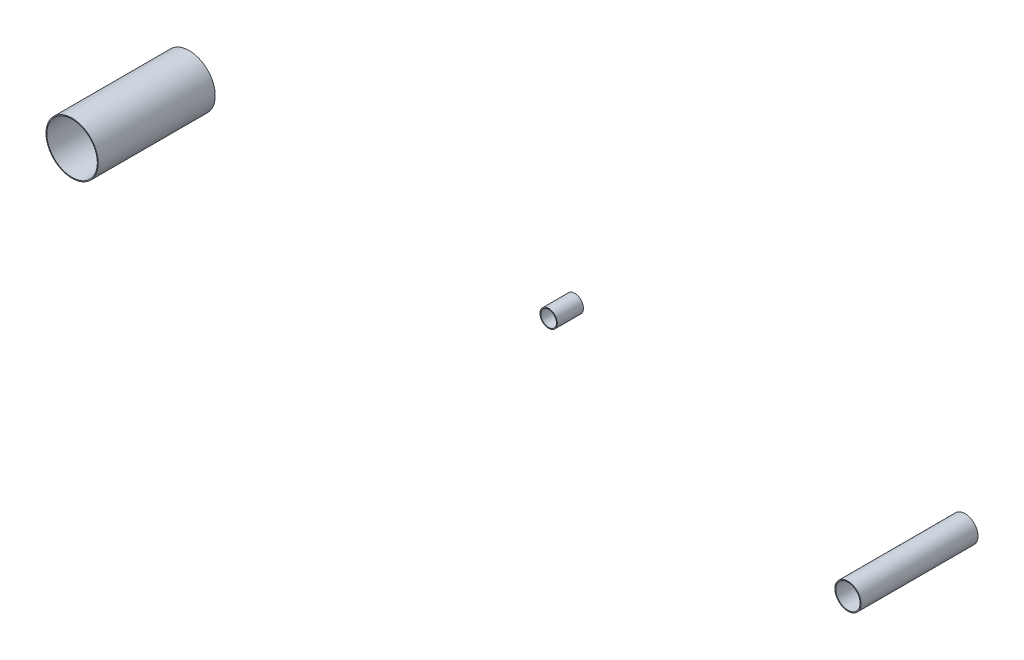
ISO-10303-21;
HEADER;
FILE_DESCRIPTION(('STEP AP214'),'2;1');
FILE_NAME('part.step','',(''),(''),'','','');
FILE_SCHEMA(('AUTOMOTIVE_DESIGN { 1 0 10303 214 1 1 1 1 }'));
ENDSEC;
DATA;
#1=APPLICATION_CONTEXT('core data for automotive mechanical design processes');
#2=APPLICATION_PROTOCOL_DEFINITION('international standard','automotive_design',2000,#1);
#3=PRODUCT_CONTEXT('',#1,'mechanical');
#4=PRODUCT('Part','Part','',(#3));
#5=PRODUCT_RELATED_PRODUCT_CATEGORY('part','',(#4));
#6=PRODUCT_DEFINITION_FORMATION('','',#4);
#7=PRODUCT_DEFINITION_CONTEXT('part definition',#1,'design');
#8=PRODUCT_DEFINITION('design','',#6,#7);
#9=PRODUCT_DEFINITION_SHAPE('','',#8);
#10=(LENGTH_UNIT() NAMED_UNIT(*) SI_UNIT(.MILLI.,.METRE.));
#11=(NAMED_UNIT(*) PLANE_ANGLE_UNIT() SI_UNIT($,.RADIAN.));
#12=(NAMED_UNIT(*) SI_UNIT($,.STERADIAN.) SOLID_ANGLE_UNIT());
#13=UNCERTAINTY_MEASURE_WITH_UNIT(LENGTH_MEASURE(1.E-05),#10,'distance_accuracy_value','');
#14=(GEOMETRIC_REPRESENTATION_CONTEXT(3) GLOBAL_UNCERTAINTY_ASSIGNED_CONTEXT((#13)) GLOBAL_UNIT_ASSIGNED_CONTEXT((#10,
#11,#12)) REPRESENTATION_CONTEXT('',''));
#15=CARTESIAN_POINT('',(0.,0.,0.));
#16=DIRECTION('',(0.,0.,1.));
#17=DIRECTION('',(1.,0.,0.));
#18=AXIS2_PLACEMENT_3D('',#15,#16,#17);
#19=CARTESIAN_POINT('',(-31046.0335157072,-16257.8595062918,41013.2906960563));
#20=DIRECTION('',(0.,0.,-1.));
#21=DIRECTION('',(-1.,0.,0.));
#22=AXIS2_PLACEMENT_3D('',#19,#20,#21);
#23=PLANE('',#22);
#24=CARTESIAN_POINT('',(-31046.0335157072,-16257.8595062918,41013.2906960563));
#25=DIRECTION('',(0.,0.,-1.));
#26=DIRECTION('',(-1.,0.,0.));
#27=AXIS2_PLACEMENT_3D('',#24,#25,#26);
#28=CIRCLE('',#27,14.0000000000006);
#29=CARTESIAN_POINT('',(-31060.0335157072,-16257.8595062918,41013.2906960563));
#30=VERTEX_POINT('',#29);
#31=EDGE_CURVE('E76',#30,#30,#28,.T.);
#32=ORIENTED_EDGE('',*,*,#31,.T.);
#33=EDGE_LOOP('',(#32));
#34=FACE_BOUND('',#33,.T.);
#35=CARTESIAN_POINT('',(-31046.0335157072,-16257.8595062918,41013.2906960563));
#36=DIRECTION('',(0.,0.,-1.));
#37=DIRECTION('',(-1.,0.,0.));
#38=AXIS2_PLACEMENT_3D('',#35,#36,#37);
#39=CIRCLE('',#38,15.0000000000006);
#40=CARTESIAN_POINT('',(-31061.0335157072,-16257.8595062918,41013.2906960563));
#41=VERTEX_POINT('',#40);
#42=EDGE_CURVE('E68',#41,#41,#39,.T.);
#43=ORIENTED_EDGE('',*,*,#42,.F.);
#44=EDGE_LOOP('',(#43));
#45=FACE_BOUND('',#44,.T.);
#46=ADVANCED_FACE('F62',(#34,#45),#23,.F.);
#47=CARTESIAN_POINT('',(-31046.0335157072,-16257.8595062918,40878.7861311589));
#48=DIRECTION('',(0.,0.,-1.));
#49=DIRECTION('',(-1.,0.,0.));
#50=AXIS2_PLACEMENT_3D('',#47,#48,#49);
#51=PLANE('',#50);
#52=CARTESIAN_POINT('',(-31046.0335157072,-16257.8595062918,40878.7861311589));
#53=DIRECTION('',(0.,0.,-1.));
#54=DIRECTION('',(-1.,0.,0.));
#55=AXIS2_PLACEMENT_3D('',#52,#53,#54);
#56=CIRCLE('',#55,14.0000000000006);
#57=CARTESIAN_POINT('',(-31060.0335157072,-16257.8595062918,40878.7861311589));
#58=VERTEX_POINT('',#57);
#59=EDGE_CURVE('E72',#58,#58,#56,.T.);
#60=ORIENTED_EDGE('',*,*,#59,.F.);
#61=EDGE_LOOP('',(#60));
#62=FACE_BOUND('',#61,.T.);
#63=CARTESIAN_POINT('',(-31046.0335157072,-16257.8595062918,40878.7861311589));
#64=DIRECTION('',(0.,0.,-1.));
#65=DIRECTION('',(-1.,0.,0.));
#66=AXIS2_PLACEMENT_3D('',#63,#64,#65);
#67=CIRCLE('',#66,15.0000000000006);
#68=CARTESIAN_POINT('',(-31061.0335157072,-16257.8595062918,40878.7861311589));
#69=VERTEX_POINT('',#68);
#70=EDGE_CURVE('E12',#69,#69,#67,.T.);
#71=ORIENTED_EDGE('',*,*,#70,.T.);
#72=EDGE_LOOP('',(#71));
#73=FACE_BOUND('',#72,.T.);
#74=ADVANCED_FACE('F92',(#62,#73),#51,.T.);
#75=CARTESIAN_POINT('',(-31046.0335157072,-16257.8595062918,41013.2906960563));
#76=DIRECTION('',(0.,0.,-1.));
#77=DIRECTION('',(-1.,0.,0.));
#78=AXIS2_PLACEMENT_3D('',#75,#76,#77);
#79=CYLINDRICAL_SURFACE('',#78,15.0000000000006);
#80=ORIENTED_EDGE('',*,*,#70,.F.);
#81=EDGE_LOOP('',(#80));
#82=FACE_BOUND('',#81,.T.);
#83=ORIENTED_EDGE('',*,*,#42,.T.);
#84=EDGE_LOOP('',(#83));
#85=FACE_BOUND('',#84,.T.);
#86=ADVANCED_FACE('F86',(#82,#85),#79,.T.);
#87=CARTESIAN_POINT('',(-31046.0335157072,-16257.8595062918,41013.2906960563));
#88=DIRECTION('',(0.,0.,-1.));
#89=DIRECTION('',(-1.,0.,0.));
#90=AXIS2_PLACEMENT_3D('',#87,#88,#89);
#91=CYLINDRICAL_SURFACE('',#90,14.0000000000006);
#92=ORIENTED_EDGE('',*,*,#59,.T.);
#93=EDGE_LOOP('',(#92));
#94=FACE_BOUND('',#93,.T.);
#95=ORIENTED_EDGE('',*,*,#31,.F.);
#96=EDGE_LOOP('',(#95));
#97=FACE_BOUND('',#96,.T.);
#98=ADVANCED_FACE('F84',(#94,#97),#91,.F.);
#99=CLOSED_SHELL('',(#46,#74,#86,#98));
#100=MANIFOLD_SOLID_BREP('B2',#99);
#101=CARTESIAN_POINT('',(-31494.4265818064,-16257.8595062918,40878.7861311589));
#102=DIRECTION('',(0.,0.,1.));
#103=DIRECTION('',(1.,0.,0.));
#104=AXIS2_PLACEMENT_3D('',#101,#102,#103);
#105=PLANE('',#104);
#106=CARTESIAN_POINT('',(-31494.4265818064,-16257.8595062918,40878.7861311589));
#107=DIRECTION('',(0.,0.,1.));
#108=DIRECTION('',(1.,0.,0.));
#109=AXIS2_PLACEMENT_3D('',#106,#107,#108);
#110=CIRCLE('',#109,9.00000000000156);
#111=CARTESIAN_POINT('',(-31485.4265818064,-16257.8595062918,40878.7861311589));
#112=VERTEX_POINT('',#111);
#113=EDGE_CURVE('E153',#112,#112,#110,.T.);
#114=ORIENTED_EDGE('',*,*,#113,.T.);
#115=EDGE_LOOP('',(#114));
#116=FACE_BOUND('',#115,.T.);
#117=CARTESIAN_POINT('',(-31494.4265818064,-16257.8595062918,40878.7861311589));
#118=DIRECTION('',(0.,0.,1.));
#119=DIRECTION('',(1.,0.,0.));
#120=AXIS2_PLACEMENT_3D('',#117,#118,#119);
#121=CIRCLE('',#120,10.0000000000016);
#122=CARTESIAN_POINT('',(-31484.4265818064,-16257.8595062918,40878.7861311589));
#123=VERTEX_POINT('',#122);
#124=EDGE_CURVE('E145',#123,#123,#121,.T.);
#125=ORIENTED_EDGE('',*,*,#124,.F.);
#126=EDGE_LOOP('',(#125));
#127=FACE_BOUND('',#126,.T.);
#128=ADVANCED_FACE('F139',(#116,#127),#105,.F.);
#129=CARTESIAN_POINT('',(-31494.4265818064,-16257.8595062918,40908.7861311589));
#130=DIRECTION('',(0.,0.,1.));
#131=DIRECTION('',(1.,0.,0.));
#132=AXIS2_PLACEMENT_3D('',#129,#130,#131);
#133=PLANE('',#132);
#134=CARTESIAN_POINT('',(-31494.4265818064,-16257.8595062918,40908.7861311589));
#135=DIRECTION('',(0.,0.,1.));
#136=DIRECTION('',(1.,0.,0.));
#137=AXIS2_PLACEMENT_3D('',#134,#135,#136);
#138=CIRCLE('',#137,9.00000000000156);
#139=CARTESIAN_POINT('',(-31485.4265818064,-16257.8595062918,40908.7861311589));
#140=VERTEX_POINT('',#139);
#141=EDGE_CURVE('E149',#140,#140,#138,.T.);
#142=ORIENTED_EDGE('',*,*,#141,.F.);
#143=EDGE_LOOP('',(#142));
#144=FACE_BOUND('',#143,.T.);
#145=CARTESIAN_POINT('',(-31494.4265818064,-16257.8595062918,40908.7861311589));
#146=DIRECTION('',(0.,0.,1.));
#147=DIRECTION('',(1.,0.,0.));
#148=AXIS2_PLACEMENT_3D('',#145,#146,#147);
#149=CIRCLE('',#148,10.0000000000016);
#150=CARTESIAN_POINT('',(-31484.4265818064,-16257.8595062918,40908.7861311589));
#151=VERTEX_POINT('',#150);
#152=EDGE_CURVE('E61',#151,#151,#149,.T.);
#153=ORIENTED_EDGE('',*,*,#152,.T.);
#154=EDGE_LOOP('',(#153));
#155=FACE_BOUND('',#154,.T.);
#156=ADVANCED_FACE('F169',(#144,#155),#133,.T.);
#157=CARTESIAN_POINT('',(-31494.4265818064,-16257.8595062918,40878.7861311589));
#158=DIRECTION('',(0.,0.,1.));
#159=DIRECTION('',(1.,0.,0.));
#160=AXIS2_PLACEMENT_3D('',#157,#158,#159);
#161=CYLINDRICAL_SURFACE('',#160,10.0000000000016);
#162=ORIENTED_EDGE('',*,*,#152,.F.);
#163=EDGE_LOOP('',(#162));
#164=FACE_BOUND('',#163,.T.);
#165=ORIENTED_EDGE('',*,*,#124,.T.);
#166=EDGE_LOOP('',(#165));
#167=FACE_BOUND('',#166,.T.);
#168=ADVANCED_FACE('F163',(#164,#167),#161,.T.);
#169=CARTESIAN_POINT('',(-31494.4265818064,-16257.8595062918,40878.7861311589));
#170=DIRECTION('',(0.,0.,1.));
#171=DIRECTION('',(1.,0.,0.));
#172=AXIS2_PLACEMENT_3D('',#169,#170,#171);
#173=CYLINDRICAL_SURFACE('',#172,9.00000000000156);
#174=ORIENTED_EDGE('',*,*,#141,.T.);
#175=EDGE_LOOP('',(#174));
#176=FACE_BOUND('',#175,.T.);
#177=ORIENTED_EDGE('',*,*,#113,.F.);
#178=EDGE_LOOP('',(#177));
#179=FACE_BOUND('',#178,.T.);
#180=ADVANCED_FACE('F161',(#176,#179),#173,.F.);
#181=CLOSED_SHELL('',(#128,#156,#168,#180));
#182=MANIFOLD_SOLID_BREP('B7',#181);
#183=CARTESIAN_POINT('',(-31937.4492832491,-16257.8595062918,41013.2906960563));
#184=DIRECTION('',(0.,-3.16959979597174E-13,-1.));
#185=DIRECTION('',(0.,1.,-3.16959979597174E-13));
#186=AXIS2_PLACEMENT_3D('',#183,#184,#185);
#187=PLANE('',#186);
#188=CARTESIAN_POINT('',(-31937.4492832491,-16257.8595062918,41013.2906960563));
#189=DIRECTION('',(0.,-3.16959979597174E-13,-1.));
#190=DIRECTION('',(0.,1.,-3.16959979597174E-13));
#191=AXIS2_PLACEMENT_3D('',#188,#189,#190);
#192=CIRCLE('',#191,29.0000000000011);
#193=CARTESIAN_POINT('',(-31937.4492832491,-16228.8595062918,41013.2906960563));
#194=VERTEX_POINT('',#193);
#195=EDGE_CURVE('E223',#194,#194,#192,.T.);
#196=ORIENTED_EDGE('',*,*,#195,.T.);
#197=EDGE_LOOP('',(#196));
#198=FACE_BOUND('',#197,.T.);
#199=CARTESIAN_POINT('',(-31937.4492832491,-16257.8595062918,41013.2906960563));
#200=DIRECTION('',(0.,-3.16959979597174E-13,-1.));
#201=DIRECTION('',(0.,1.,-3.16959979597174E-13));
#202=AXIS2_PLACEMENT_3D('',#199,#200,#201);
#203=CIRCLE('',#202,30.0000000000011);
#204=CARTESIAN_POINT('',(-31937.4492832491,-16227.8595062918,41013.2906960563));
#205=VERTEX_POINT('',#204);
#206=EDGE_CURVE('E215',#205,#205,#203,.T.);
#207=ORIENTED_EDGE('',*,*,#206,.F.);
#208=EDGE_LOOP('',(#207));
#209=FACE_BOUND('',#208,.T.);
#210=ADVANCED_FACE('F209',(#198,#209),#187,.F.);
#211=CARTESIAN_POINT('',(-31937.4492832491,-16257.8595062918,40878.7861311589));
#212=DIRECTION('',(0.,-3.16959979597174E-13,-1.));
#213=DIRECTION('',(0.,1.,-3.16959979597174E-13));
#214=AXIS2_PLACEMENT_3D('',#211,#212,#213);
#215=PLANE('',#214);
#216=CARTESIAN_POINT('',(-31937.4492832491,-16257.8595062918,40878.7861311589));
#217=DIRECTION('',(0.,-3.16959979597174E-13,-1.));
#218=DIRECTION('',(0.,1.,-3.16959979597174E-13));
#219=AXIS2_PLACEMENT_3D('',#216,#217,#218);
#220=CIRCLE('',#219,29.0000000000011);
#221=CARTESIAN_POINT('',(-31937.4492832491,-16228.8595062918,40878.7861311589));
#222=VERTEX_POINT('',#221);
#223=EDGE_CURVE('E219',#222,#222,#220,.T.);
#224=ORIENTED_EDGE('',*,*,#223,.F.);
#225=EDGE_LOOP('',(#224));
#226=FACE_BOUND('',#225,.T.);
#227=CARTESIAN_POINT('',(-31937.4492832491,-16257.8595062918,40878.7861311589));
#228=DIRECTION('',(0.,-3.16959979597174E-13,-1.));
#229=DIRECTION('',(0.,1.,-3.16959979597174E-13));
#230=AXIS2_PLACEMENT_3D('',#227,#228,#229);
#231=CIRCLE('',#230,30.0000000000011);
#232=CARTESIAN_POINT('',(-31937.4492832491,-16227.8595062918,40878.7861311589));
#233=VERTEX_POINT('',#232);
#234=EDGE_CURVE('E138',#233,#233,#231,.T.);
#235=ORIENTED_EDGE('',*,*,#234,.T.);
#236=EDGE_LOOP('',(#235));
#237=FACE_BOUND('',#236,.T.);
#238=ADVANCED_FACE('F239',(#226,#237),#215,.T.);
#239=CARTESIAN_POINT('',(-31937.4492832491,-16257.8595062918,41013.2906960563));
#240=DIRECTION('',(0.,-3.16959979597174E-13,-1.));
#241=DIRECTION('',(0.,1.,-3.16959979597174E-13));
#242=AXIS2_PLACEMENT_3D('',#239,#240,#241);
#243=CYLINDRICAL_SURFACE('',#242,30.0000000000011);
#244=ORIENTED_EDGE('',*,*,#234,.F.);
#245=EDGE_LOOP('',(#244));
#246=FACE_BOUND('',#245,.T.);
#247=ORIENTED_EDGE('',*,*,#206,.T.);
#248=EDGE_LOOP('',(#247));
#249=FACE_BOUND('',#248,.T.);
#250=ADVANCED_FACE('F233',(#246,#249),#243,.T.);
#251=CARTESIAN_POINT('',(-31937.4492832491,-16257.8595062918,41013.2906960563));
#252=DIRECTION('',(0.,-3.16959979597174E-13,-1.));
#253=DIRECTION('',(0.,1.,-3.16959979597174E-13));
#254=AXIS2_PLACEMENT_3D('',#251,#252,#253);
#255=CYLINDRICAL_SURFACE('',#254,29.0000000000011);
#256=ORIENTED_EDGE('',*,*,#223,.T.);
#257=EDGE_LOOP('',(#256));
#258=FACE_BOUND('',#257,.T.);
#259=ORIENTED_EDGE('',*,*,#195,.F.);
#260=EDGE_LOOP('',(#259));
#261=FACE_BOUND('',#260,.T.);
#262=ADVANCED_FACE('F231',(#258,#261),#255,.F.);
#263=CLOSED_SHELL('',(#210,#238,#250,#262));
#264=MANIFOLD_SOLID_BREP('B56',#263);
#265=ADVANCED_BREP_SHAPE_REPRESENTATION('',(#18,#100,#182,#264),#14);
#266=SHAPE_DEFINITION_REPRESENTATION(#9,#265);
ENDSEC;
END-ISO-10303-21;
